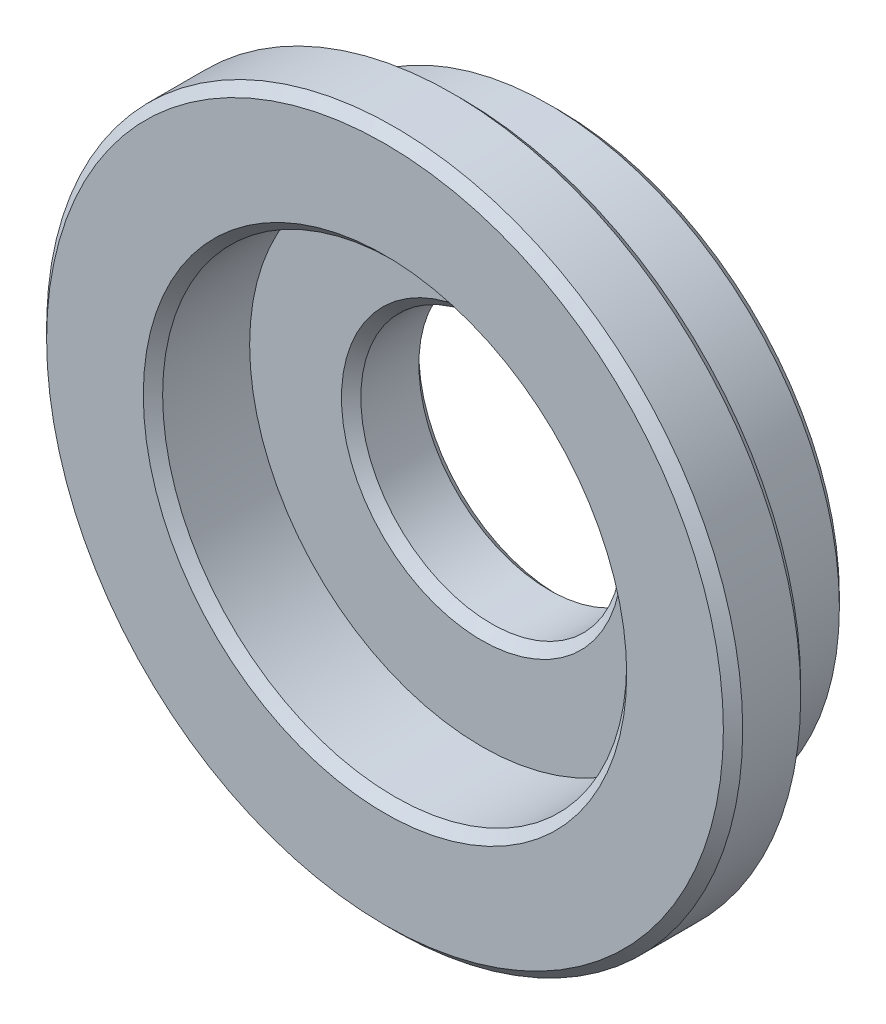
ISO-10303-21;
HEADER;
FILE_DESCRIPTION(('STEP AP214'),'2;1');
FILE_NAME('part.step','',(''),(''),'','','');
FILE_SCHEMA(('AUTOMOTIVE_DESIGN { 1 0 10303 214 1 1 1 1 }'));
ENDSEC;
DATA;
#1=APPLICATION_CONTEXT('core data for automotive mechanical design processes');
#2=APPLICATION_PROTOCOL_DEFINITION('international standard','automotive_design',2000,#1);
#3=PRODUCT_CONTEXT('',#1,'mechanical');
#4=PRODUCT('Part','Part','',(#3));
#5=PRODUCT_RELATED_PRODUCT_CATEGORY('part','',(#4));
#6=PRODUCT_DEFINITION_FORMATION('','',#4);
#7=PRODUCT_DEFINITION_CONTEXT('part definition',#1,'design');
#8=PRODUCT_DEFINITION('design','',#6,#7);
#9=PRODUCT_DEFINITION_SHAPE('','',#8);
#10=(LENGTH_UNIT() NAMED_UNIT(*) SI_UNIT(.MILLI.,.METRE.));
#11=(NAMED_UNIT(*) PLANE_ANGLE_UNIT() SI_UNIT($,.RADIAN.));
#12=(NAMED_UNIT(*) SI_UNIT($,.STERADIAN.) SOLID_ANGLE_UNIT());
#13=UNCERTAINTY_MEASURE_WITH_UNIT(LENGTH_MEASURE(1.E-05),#10,'distance_accuracy_value','');
#14=(GEOMETRIC_REPRESENTATION_CONTEXT(3) GLOBAL_UNCERTAINTY_ASSIGNED_CONTEXT((#13)) GLOBAL_UNIT_ASSIGNED_CONTEXT((#10,
#11,#12)) REPRESENTATION_CONTEXT('',''));
#15=CARTESIAN_POINT('',(0.,0.,0.));
#16=DIRECTION('',(0.,0.,1.));
#17=DIRECTION('',(1.,0.,0.));
#18=AXIS2_PLACEMENT_3D('',#15,#16,#17);
#19=CARTESIAN_POINT('',(0.,0.,0.699999999985221));
#20=DIRECTION('',(0.,0.,1.));
#21=DIRECTION('',(1.,0.,0.));
#22=AXIS2_PLACEMENT_3D('',#19,#20,#21);
#23=CONICAL_SURFACE('',#22,2.40000000000814,0.785398163397447);
#24=CARTESIAN_POINT('',(0.,0.,0.800000000025785));
#25=DIRECTION('',(0.,0.,1.));
#26=DIRECTION('',(1.,0.,0.));
#27=AXIS2_PLACEMENT_3D('',#24,#25,#26);
#28=CIRCLE('',#27,2.5000000000487);
#29=CARTESIAN_POINT('',(2.5000000000487,0.,0.800000000025785));
#30=VERTEX_POINT('',#29);
#31=EDGE_CURVE('E10',#30,#30,#28,.T.);
#32=ORIENTED_EDGE('',*,*,#31,.T.);
#33=EDGE_LOOP('',(#32));
#34=FACE_BOUND('',#33,.T.);
#35=CARTESIAN_POINT('',(0.,0.,0.699999999985221));
#36=DIRECTION('',(0.,0.,1.));
#37=DIRECTION('',(1.,0.,0.));
#38=AXIS2_PLACEMENT_3D('',#35,#36,#37);
#39=CIRCLE('',#38,2.40000000000814);
#40=CARTESIAN_POINT('',(2.40000000000814,0.,0.699999999985221));
#41=VERTEX_POINT('',#40);
#42=EDGE_CURVE('E60',#41,#41,#39,.T.);
#43=ORIENTED_EDGE('',*,*,#42,.F.);
#44=EDGE_LOOP('',(#43));
#45=FACE_BOUND('',#44,.T.);
#46=ADVANCED_FACE('F14',(#34,#45),#23,.F.);
#47=CARTESIAN_POINT('',(2.5000000000487,0.,0.800000000025785));
#48=DIRECTION('',(0.,0.,1.));
#49=DIRECTION('',(1.,0.,0.));
#50=AXIS2_PLACEMENT_3D('',#47,#48,#49);
#51=PLANE('',#50);
#52=CARTESIAN_POINT('',(0.,0.,0.800000000025785));
#53=DIRECTION('',(0.,0.,1.));
#54=DIRECTION('',(1.,0.,0.));
#55=AXIS2_PLACEMENT_3D('',#52,#53,#54);
#56=CIRCLE('',#55,3.49999999996821);
#57=CARTESIAN_POINT('',(3.49999999996821,0.,0.800000000025785));
#58=VERTEX_POINT('',#57);
#59=EDGE_CURVE('E20',#58,#58,#56,.T.);
#60=ORIENTED_EDGE('',*,*,#59,.T.);
#61=EDGE_LOOP('',(#60));
#62=FACE_BOUND('',#61,.T.);
#63=ORIENTED_EDGE('',*,*,#31,.F.);
#64=EDGE_LOOP('',(#63));
#65=FACE_BOUND('',#64,.T.);
#66=ADVANCED_FACE('F68',(#62,#65),#51,.T.);
#67=CARTESIAN_POINT('',(0.,0.,0.800000000025785));
#68=DIRECTION('',(0.,0.,-1.));
#69=DIRECTION('',(-1.,0.,0.));
#70=AXIS2_PLACEMENT_3D('',#67,#68,#69);
#71=CONICAL_SURFACE('',#70,3.49999999996821,0.785398163397449);
#72=CARTESIAN_POINT('',(0.,0.,0.699999999999546));
#73=DIRECTION('',(0.,0.,1.));
#74=DIRECTION('',(1.,0.,0.));
#75=AXIS2_PLACEMENT_3D('',#72,#73,#74);
#76=CIRCLE('',#75,3.59999999999445);
#77=CARTESIAN_POINT('',(3.59999999999445,0.,0.699999999999546));
#78=VERTEX_POINT('',#77);
#79=EDGE_CURVE('E24',#78,#78,#76,.T.);
#80=ORIENTED_EDGE('',*,*,#79,.T.);
#81=EDGE_LOOP('',(#80));
#82=FACE_BOUND('',#81,.T.);
#83=ORIENTED_EDGE('',*,*,#59,.F.);
#84=EDGE_LOOP('',(#83));
#85=FACE_BOUND('',#84,.T.);
#86=ADVANCED_FACE('F73',(#82,#85),#71,.T.);
#87=CARTESIAN_POINT('',(0.,0.,-1.));
#88=DIRECTION('',(0.,0.,1.));
#89=DIRECTION('',(1.,0.,0.));
#90=AXIS2_PLACEMENT_3D('',#87,#88,#89);
#91=CYLINDRICAL_SURFACE('',#90,3.59999999999445);
#92=CARTESIAN_POINT('',(0.,0.,0.100000000031287));
#93=DIRECTION('',(0.,0.,1.));
#94=DIRECTION('',(1.,0.,0.));
#95=AXIS2_PLACEMENT_3D('',#92,#93,#94);
#96=CIRCLE('',#95,3.59999999999445);
#97=CARTESIAN_POINT('',(3.59999999999445,0.,0.100000000031287));
#98=VERTEX_POINT('',#97);
#99=EDGE_CURVE('E28',#98,#98,#96,.T.);
#100=ORIENTED_EDGE('',*,*,#99,.T.);
#101=EDGE_LOOP('',(#100));
#102=FACE_BOUND('',#101,.T.);
#103=ORIENTED_EDGE('',*,*,#79,.F.);
#104=EDGE_LOOP('',(#103));
#105=FACE_BOUND('',#104,.T.);
#106=ADVANCED_FACE('F77',(#102,#105),#91,.T.);
#107=CARTESIAN_POINT('',(0.,0.,0.100000000031287));
#108=DIRECTION('',(0.,0.,1.));
#109=DIRECTION('',(1.,0.,0.));
#110=AXIS2_PLACEMENT_3D('',#107,#108,#109);
#111=CONICAL_SURFACE('',#110,3.59999999999445,0.785398163397448);
#112=CARTESIAN_POINT('',(0.,0.,2.79672118796981E-11));
#113=DIRECTION('',(0.,0.,1.));
#114=DIRECTION('',(1.,0.,0.));
#115=AXIS2_PLACEMENT_3D('',#112,#113,#114);
#116=CIRCLE('',#115,3.49999999999113);
#117=CARTESIAN_POINT('',(3.49999999999113,0.,2.79672118796981E-11));
#118=VERTEX_POINT('',#117);
#119=EDGE_CURVE('E33',#118,#118,#116,.T.);
#120=ORIENTED_EDGE('',*,*,#119,.T.);
#121=EDGE_LOOP('',(#120));
#122=FACE_BOUND('',#121,.T.);
#123=ORIENTED_EDGE('',*,*,#99,.F.);
#124=EDGE_LOOP('',(#123));
#125=FACE_BOUND('',#124,.T.);
#126=ADVANCED_FACE('F84',(#122,#125),#111,.T.);
#127=CARTESIAN_POINT('',(3.49999999999113,0.,2.79673291979469E-11));
#128=DIRECTION('',(0.,0.,-1.));
#129=DIRECTION('',(-1.,0.,0.));
#130=AXIS2_PLACEMENT_3D('',#127,#128,#129);
#131=PLANE('',#130);
#132=CARTESIAN_POINT('',(0.,0.,2.79674287201326E-11));
#133=DIRECTION('',(0.,0.,1.));
#134=DIRECTION('',(1.,0.,0.));
#135=AXIS2_PLACEMENT_3D('',#132,#133,#134);
#136=CIRCLE('',#135,3.00000000001214);
#137=CARTESIAN_POINT('',(3.00000000001214,0.,2.79674287201326E-11));
#138=VERTEX_POINT('',#137);
#139=EDGE_CURVE('E36',#138,#138,#136,.T.);
#140=ORIENTED_EDGE('',*,*,#139,.T.);
#141=EDGE_LOOP('',(#140));
#142=FACE_BOUND('',#141,.T.);
#143=ORIENTED_EDGE('',*,*,#119,.F.);
#144=EDGE_LOOP('',(#143));
#145=FACE_BOUND('',#144,.T.);
#146=ADVANCED_FACE('F88',(#142,#145),#131,.T.);
#147=CARTESIAN_POINT('',(0.,0.,-1.));
#148=DIRECTION('',(0.,0.,1.));
#149=DIRECTION('',(1.,0.,0.));
#150=AXIS2_PLACEMENT_3D('',#147,#148,#149);
#151=CYLINDRICAL_SURFACE('',#150,3.00000000001214);
#152=CARTESIAN_POINT('',(0.,0.,-0.899999999973034));
#153=DIRECTION('',(0.,0.,1.));
#154=DIRECTION('',(1.,0.,0.));
#155=AXIS2_PLACEMENT_3D('',#152,#153,#154);
#156=CIRCLE('',#155,3.00000000001214);
#157=CARTESIAN_POINT('',(3.00000000001214,0.,-0.899999999973034));
#158=VERTEX_POINT('',#157);
#159=EDGE_CURVE('E39',#158,#158,#156,.T.);
#160=ORIENTED_EDGE('',*,*,#159,.T.);
#161=EDGE_LOOP('',(#160));
#162=FACE_BOUND('',#161,.T.);
#163=ORIENTED_EDGE('',*,*,#139,.F.);
#164=EDGE_LOOP('',(#163));
#165=FACE_BOUND('',#164,.T.);
#166=ADVANCED_FACE('F92',(#162,#165),#151,.T.);
#167=CARTESIAN_POINT('',(0.,0.,-0.899999999973034));
#168=DIRECTION('',(0.,0.,1.));
#169=DIRECTION('',(1.,0.,0.));
#170=AXIS2_PLACEMENT_3D('',#167,#168,#169);
#171=CONICAL_SURFACE('',#170,3.00000000001214,0.785398163397449);
#172=CARTESIAN_POINT('',(0.,0.,-0.999999999976353));
#173=DIRECTION('',(0.,0.,1.));
#174=DIRECTION('',(1.,0.,0.));
#175=AXIS2_PLACEMENT_3D('',#172,#173,#174);
#176=CIRCLE('',#175,2.90000000000882);
#177=CARTESIAN_POINT('',(2.90000000000882,0.,-0.999999999976353));
#178=VERTEX_POINT('',#177);
#179=EDGE_CURVE('E42',#178,#178,#176,.T.);
#180=ORIENTED_EDGE('',*,*,#179,.T.);
#181=EDGE_LOOP('',(#180));
#182=FACE_BOUND('',#181,.T.);
#183=ORIENTED_EDGE('',*,*,#159,.F.);
#184=EDGE_LOOP('',(#183));
#185=FACE_BOUND('',#184,.T.);
#186=ADVANCED_FACE('F96',(#182,#185),#171,.T.);
#187=CARTESIAN_POINT('',(2.90000000000882,0.,-0.999999999976353));
#188=DIRECTION('',(0.,0.,-1.));
#189=DIRECTION('',(-1.,0.,0.));
#190=AXIS2_PLACEMENT_3D('',#187,#188,#189);
#191=PLANE('',#190);
#192=CARTESIAN_POINT('',(0.,0.,-0.999999999976353));
#193=DIRECTION('',(0.,0.,1.));
#194=DIRECTION('',(1.,0.,0.));
#195=AXIS2_PLACEMENT_3D('',#192,#193,#194);
#196=CIRCLE('',#195,1.4499999999749);
#197=CARTESIAN_POINT('',(1.4499999999749,0.,-0.999999999976353));
#198=VERTEX_POINT('',#197);
#199=EDGE_CURVE('E45',#198,#198,#196,.T.);
#200=ORIENTED_EDGE('',*,*,#199,.T.);
#201=EDGE_LOOP('',(#200));
#202=FACE_BOUND('',#201,.T.);
#203=ORIENTED_EDGE('',*,*,#179,.F.);
#204=EDGE_LOOP('',(#203));
#205=FACE_BOUND('',#204,.T.);
#206=ADVANCED_FACE('F100',(#202,#205),#191,.T.);
#207=CARTESIAN_POINT('',(0.,0.,-0.999999999976353));
#208=DIRECTION('',(0.,0.,-1.));
#209=DIRECTION('',(-1.,0.,0.));
#210=AXIS2_PLACEMENT_3D('',#207,#208,#209);
#211=CONICAL_SURFACE('',#210,1.4499999999749,0.785398163397448);
#212=CARTESIAN_POINT('',(0.,0.,-0.900000000001455));
#213=DIRECTION('',(0.,0.,1.));
#214=DIRECTION('',(1.,0.,0.));
#215=AXIS2_PLACEMENT_3D('',#212,#213,#214);
#216=CIRCLE('',#215,1.35);
#217=CARTESIAN_POINT('',(1.35,0.,-0.900000000001455));
#218=VERTEX_POINT('',#217);
#219=EDGE_CURVE('E48',#218,#218,#216,.T.);
#220=ORIENTED_EDGE('',*,*,#219,.T.);
#221=EDGE_LOOP('',(#220));
#222=FACE_BOUND('',#221,.T.);
#223=ORIENTED_EDGE('',*,*,#199,.F.);
#224=EDGE_LOOP('',(#223));
#225=FACE_BOUND('',#224,.T.);
#226=ADVANCED_FACE('F104',(#222,#225),#211,.F.);
#227=CARTESIAN_POINT('',(0.,0.,-1.));
#228=DIRECTION('',(0.,0.,1.));
#229=DIRECTION('',(1.,0.,0.));
#230=AXIS2_PLACEMENT_3D('',#227,#228,#229);
#231=CYLINDRICAL_SURFACE('',#230,1.35);
#232=CARTESIAN_POINT('',(0.,0.,-0.3));
#233=DIRECTION('',(0.,0.,1.));
#234=DIRECTION('',(1.,0.,0.));
#235=AXIS2_PLACEMENT_3D('',#232,#233,#234);
#236=CIRCLE('',#235,1.35);
#237=CARTESIAN_POINT('',(1.35,0.,-0.3));
#238=VERTEX_POINT('',#237);
#239=EDGE_CURVE('E51',#238,#238,#236,.T.);
#240=ORIENTED_EDGE('',*,*,#239,.T.);
#241=EDGE_LOOP('',(#240));
#242=FACE_BOUND('',#241,.T.);
#243=ORIENTED_EDGE('',*,*,#219,.F.);
#244=EDGE_LOOP('',(#243));
#245=FACE_BOUND('',#244,.T.);
#246=ADVANCED_FACE('F108',(#242,#245),#231,.F.);
#247=CARTESIAN_POINT('',(0.,0.,-0.3));
#248=DIRECTION('',(0.,0.,1.));
#249=DIRECTION('',(1.,0.,0.));
#250=AXIS2_PLACEMENT_3D('',#247,#248,#249);
#251=CONICAL_SURFACE('',#250,1.35,0.785398163397448);
#252=CARTESIAN_POINT('',(0.,0.,-0.200000000014779));
#253=DIRECTION('',(0.,0.,1.));
#254=DIRECTION('',(1.,0.,0.));
#255=AXIS2_PLACEMENT_3D('',#252,#253,#254);
#256=CIRCLE('',#255,1.44999999998522);
#257=CARTESIAN_POINT('',(1.44999999998522,0.,-0.200000000014779));
#258=VERTEX_POINT('',#257);
#259=EDGE_CURVE('E54',#258,#258,#256,.T.);
#260=ORIENTED_EDGE('',*,*,#259,.T.);
#261=EDGE_LOOP('',(#260));
#262=FACE_BOUND('',#261,.T.);
#263=ORIENTED_EDGE('',*,*,#239,.F.);
#264=EDGE_LOOP('',(#263));
#265=FACE_BOUND('',#264,.T.);
#266=ADVANCED_FACE('F112',(#262,#265),#251,.F.);
#267=CARTESIAN_POINT('',(1.44999999998522,0.,-0.200000000014779));
#268=DIRECTION('',(0.,0.,1.));
#269=DIRECTION('',(1.,0.,0.));
#270=AXIS2_PLACEMENT_3D('',#267,#268,#269);
#271=PLANE('',#270);
#272=CARTESIAN_POINT('',(0.,0.,-0.200000000014779));
#273=DIRECTION('',(0.,0.,1.));
#274=DIRECTION('',(1.,0.,0.));
#275=AXIS2_PLACEMENT_3D('',#272,#273,#274);
#276=CIRCLE('',#275,2.40000000000814);
#277=CARTESIAN_POINT('',(2.40000000000814,0.,-0.200000000014779));
#278=VERTEX_POINT('',#277);
#279=EDGE_CURVE('E57',#278,#278,#276,.T.);
#280=ORIENTED_EDGE('',*,*,#279,.T.);
#281=EDGE_LOOP('',(#280));
#282=FACE_BOUND('',#281,.T.);
#283=ORIENTED_EDGE('',*,*,#259,.F.);
#284=EDGE_LOOP('',(#283));
#285=FACE_BOUND('',#284,.T.);
#286=ADVANCED_FACE('F116',(#282,#285),#271,.T.);
#287=CARTESIAN_POINT('',(0.,0.,-1.));
#288=DIRECTION('',(0.,0.,1.));
#289=DIRECTION('',(1.,0.,0.));
#290=AXIS2_PLACEMENT_3D('',#287,#288,#289);
#291=CYLINDRICAL_SURFACE('',#290,2.40000000000814);
#292=ORIENTED_EDGE('',*,*,#42,.T.);
#293=EDGE_LOOP('',(#292));
#294=FACE_BOUND('',#293,.T.);
#295=ORIENTED_EDGE('',*,*,#279,.F.);
#296=EDGE_LOOP('',(#295));
#297=FACE_BOUND('',#296,.T.);
#298=ADVANCED_FACE('F64',(#294,#297),#291,.F.);
#299=CLOSED_SHELL('',(#46,#66,#86,#106,#126,#146,#166,#186,#206,#226,#246,#266,#286,#298));
#300=MANIFOLD_SOLID_BREP('B1',#299);
#301=ADVANCED_BREP_SHAPE_REPRESENTATION('',(#18,#300),#14);
#302=SHAPE_DEFINITION_REPRESENTATION(#9,#301);
ENDSEC;
END-ISO-10303-21;
